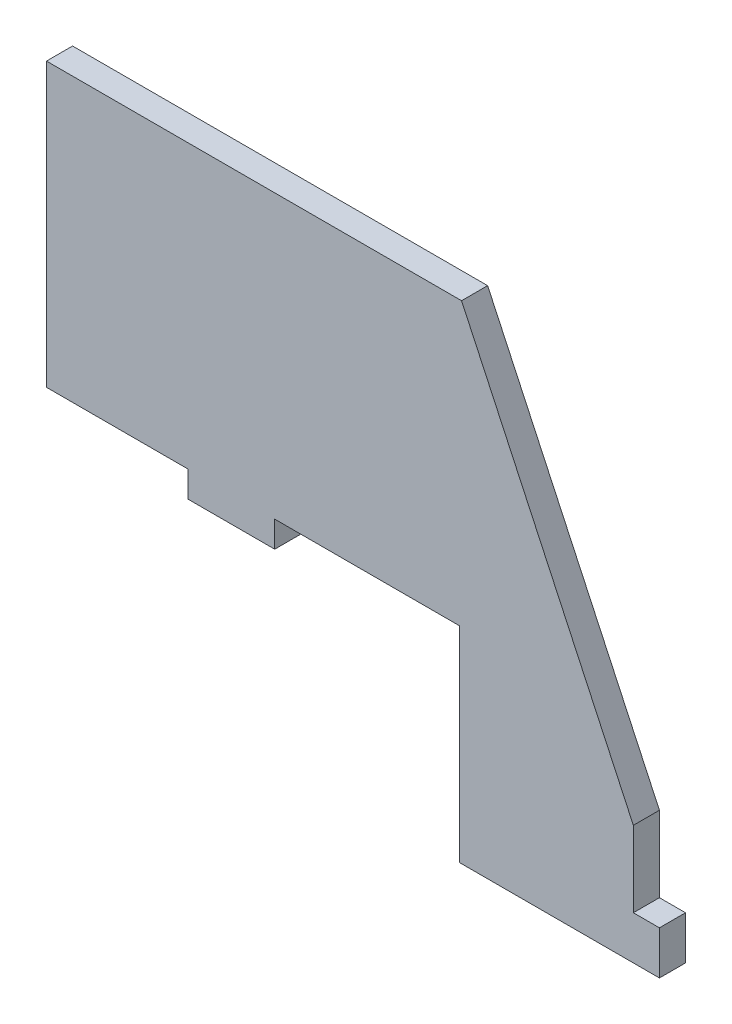
ISO-10303-21;
HEADER;
FILE_DESCRIPTION(('STEP AP214'),'2;1');
FILE_NAME('part.step','',(''),(''),'','','');
FILE_SCHEMA(('AUTOMOTIVE_DESIGN { 1 0 10303 214 1 1 1 1 }'));
ENDSEC;
DATA;
#1=APPLICATION_CONTEXT('core data for automotive mechanical design processes');
#2=APPLICATION_PROTOCOL_DEFINITION('international standard','automotive_design',2000,#1);
#3=PRODUCT_CONTEXT('',#1,'mechanical');
#4=PRODUCT('Part','Part','',(#3));
#5=PRODUCT_RELATED_PRODUCT_CATEGORY('part','',(#4));
#6=PRODUCT_DEFINITION_FORMATION('','',#4);
#7=PRODUCT_DEFINITION_CONTEXT('part definition',#1,'design');
#8=PRODUCT_DEFINITION('design','',#6,#7);
#9=PRODUCT_DEFINITION_SHAPE('','',#8);
#10=(LENGTH_UNIT() NAMED_UNIT(*) SI_UNIT(.MILLI.,.METRE.));
#11=(NAMED_UNIT(*) PLANE_ANGLE_UNIT() SI_UNIT($,.RADIAN.));
#12=(NAMED_UNIT(*) SI_UNIT($,.STERADIAN.) SOLID_ANGLE_UNIT());
#13=UNCERTAINTY_MEASURE_WITH_UNIT(LENGTH_MEASURE(1.E-05),#10,'distance_accuracy_value','');
#14=(GEOMETRIC_REPRESENTATION_CONTEXT(3) GLOBAL_UNCERTAINTY_ASSIGNED_CONTEXT((#13)) GLOBAL_UNIT_ASSIGNED_CONTEXT((#10,
#11,#12)) REPRESENTATION_CONTEXT('',''));
#15=CARTESIAN_POINT('',(0.,0.,0.));
#16=DIRECTION('',(0.,0.,1.));
#17=DIRECTION('',(1.,0.,0.));
#18=AXIS2_PLACEMENT_3D('',#15,#16,#17);
#19=CARTESIAN_POINT('',(-38.5,-8.91500000000001,0.));
#20=DIRECTION('',(0.,1.,0.));
#21=DIRECTION('',(0.,0.,1.));
#22=AXIS2_PLACEMENT_3D('',#19,#20,#21);
#23=PLANE('',#22);
#24=DIRECTION('',(-1.,0.,0.));
#25=VECTOR('',#24,1.);
#26=CARTESIAN_POINT('',(-38.5,-8.91500000000001,0.));
#27=LINE('',#26,#25);
#28=CARTESIAN_POINT('',(-35.,-8.91500000000001,0.));
#29=VERTEX_POINT('',#28);
#30=CARTESIAN_POINT('',(-67.5,-8.91500000000001,0.));
#31=VERTEX_POINT('',#30);
#32=EDGE_CURVE('E50',#29,#31,#27,.T.);
#33=ORIENTED_EDGE('',*,*,#32,.F.);
#34=DIRECTION('',(0.,0.,1.));
#35=VECTOR('',#34,1.);
#36=CARTESIAN_POINT('',(-35.,-8.915,0.));
#37=LINE('',#36,#35);
#38=CARTESIAN_POINT('',(-35.,-8.915,6.));
#39=VERTEX_POINT('',#38);
#40=EDGE_CURVE('E154',#29,#39,#37,.T.);
#41=ORIENTED_EDGE('',*,*,#40,.T.);
#42=DIRECTION('',(-1.,0.,0.));
#43=VECTOR('',#42,1.);
#44=CARTESIAN_POINT('',(-38.5,-8.91500000000001,6.));
#45=LINE('',#44,#43);
#46=CARTESIAN_POINT('',(-67.5,-8.91500000000001,6.));
#47=VERTEX_POINT('',#46);
#48=EDGE_CURVE('E221',#39,#47,#45,.T.);
#49=ORIENTED_EDGE('',*,*,#48,.T.);
#50=DIRECTION('',(0.,0.,1.));
#51=VECTOR('',#50,1.);
#52=CARTESIAN_POINT('',(-67.5,-8.91500000000001,0.));
#53=LINE('',#52,#51);
#54=EDGE_CURVE('E226',#31,#47,#53,.T.);
#55=ORIENTED_EDGE('',*,*,#54,.F.);
#56=EDGE_LOOP('',(#33,#41,#49,#55));
#57=FACE_BOUND('',#56,.T.);
#58=ADVANCED_FACE('F33',(#57),#23,.F.);
#59=CARTESIAN_POINT('',(67.5,56.085,6.));
#60=DIRECTION('',(-1.,0.,0.));
#61=DIRECTION('',(0.,0.,1.));
#62=AXIS2_PLACEMENT_3D('',#59,#60,#61);
#63=PLANE('',#62);
#64=DIRECTION('',(0.,0.,1.));
#65=VECTOR('',#64,1.);
#66=CARTESIAN_POINT('',(67.5,-46.085,0.));
#67=LINE('',#66,#65);
#68=CARTESIAN_POINT('',(67.5,-46.085,0.));
#69=VERTEX_POINT('',#68);
#70=CARTESIAN_POINT('',(67.5,-46.085,6.));
#71=VERTEX_POINT('',#70);
#72=EDGE_CURVE('E180',#69,#71,#67,.T.);
#73=ORIENTED_EDGE('',*,*,#72,.F.);
#74=DIRECTION('',(0.,1.,0.));
#75=VECTOR('',#74,1.);
#76=CARTESIAN_POINT('',(67.5,56.085,0.));
#77=LINE('',#76,#75);
#78=CARTESIAN_POINT('',(67.5,-28.6649999999999,0.));
#79=VERTEX_POINT('',#78);
#80=EDGE_CURVE('E242',#69,#79,#77,.T.);
#81=ORIENTED_EDGE('',*,*,#80,.T.);
#82=DIRECTION('',(0.,0.,1.));
#83=VECTOR('',#82,1.);
#84=CARTESIAN_POINT('',(67.5,-28.665,0.));
#85=LINE('',#84,#83);
#86=CARTESIAN_POINT('',(67.5,-28.665,6.));
#87=VERTEX_POINT('',#86);
#88=EDGE_CURVE('E207',#79,#87,#85,.T.);
#89=ORIENTED_EDGE('',*,*,#88,.T.);
#90=DIRECTION('',(0.,1.,0.));
#91=VECTOR('',#90,1.);
#92=CARTESIAN_POINT('',(67.5,56.085,6.));
#93=LINE('',#92,#91);
#94=EDGE_CURVE('E185',#71,#87,#93,.T.);
#95=ORIENTED_EDGE('',*,*,#94,.F.);
#96=EDGE_LOOP('',(#73,#81,#89,#95));
#97=FACE_BOUND('',#96,.T.);
#98=ADVANCED_FACE('F261',(#97),#63,.F.);
#99=CARTESIAN_POINT('',(-67.5,56.085,6.));
#100=DIRECTION('',(1.,0.,0.));
#101=DIRECTION('',(0.,0.,-1.));
#102=AXIS2_PLACEMENT_3D('',#99,#100,#101);
#103=PLANE('',#102);
#104=DIRECTION('',(0.,-1.,0.));
#105=VECTOR('',#104,1.);
#106=CARTESIAN_POINT('',(-67.5,56.085,0.));
#107=LINE('',#106,#105);
#108=CARTESIAN_POINT('',(-67.5,56.085,0.));
#109=VERTEX_POINT('',#108);
#110=EDGE_CURVE('E225',#109,#31,#107,.T.);
#111=ORIENTED_EDGE('',*,*,#110,.T.);
#112=ORIENTED_EDGE('',*,*,#54,.T.);
#113=DIRECTION('',(0.,-1.,0.));
#114=VECTOR('',#113,1.);
#115=CARTESIAN_POINT('',(-67.5,56.085,6.));
#116=LINE('',#115,#114);
#117=CARTESIAN_POINT('',(-67.5,56.085,6.));
#118=VERTEX_POINT('',#117);
#119=EDGE_CURVE('E230',#118,#47,#116,.T.);
#120=ORIENTED_EDGE('',*,*,#119,.F.);
#121=DIRECTION('',(0.,0.,-1.));
#122=VECTOR('',#121,1.);
#123=CARTESIAN_POINT('',(-67.5,56.085,6.));
#124=LINE('',#123,#122);
#125=EDGE_CURVE('E11',#118,#109,#124,.T.);
#126=ORIENTED_EDGE('',*,*,#125,.T.);
#127=EDGE_LOOP('',(#111,#112,#120,#126));
#128=FACE_BOUND('',#127,.T.);
#129=ADVANCED_FACE('F35',(#128),#103,.F.);
#130=CARTESIAN_POINT('',(-67.5,-56.085,6.));
#131=DIRECTION('',(0.,1.,0.));
#132=DIRECTION('',(0.,0.,1.));
#133=AXIS2_PLACEMENT_3D('',#130,#131,#132);
#134=PLANE('',#133);
#135=DIRECTION('',(1.,0.,0.));
#136=VECTOR('',#135,1.);
#137=CARTESIAN_POINT('',(-67.5,-56.085,6.));
#138=LINE('',#137,#136);
#139=CARTESIAN_POINT('',(27.5,-56.085,6.));
#140=VERTEX_POINT('',#139);
#141=CARTESIAN_POINT('',(73.5,-56.085,6.));
#142=VERTEX_POINT('',#141);
#143=EDGE_CURVE('E233',#140,#142,#138,.T.);
#144=ORIENTED_EDGE('',*,*,#143,.F.);
#145=DIRECTION('',(0.,0.,1.));
#146=VECTOR('',#145,1.);
#147=CARTESIAN_POINT('',(27.5,-56.085,0.));
#148=LINE('',#147,#146);
#149=CARTESIAN_POINT('',(27.5,-56.085,0.));
#150=VERTEX_POINT('',#149);
#151=EDGE_CURVE('E223',#150,#140,#148,.T.);
#152=ORIENTED_EDGE('',*,*,#151,.F.);
#153=DIRECTION('',(1.,0.,0.));
#154=VECTOR('',#153,1.);
#155=CARTESIAN_POINT('',(-67.5,-56.085,0.));
#156=LINE('',#155,#154);
#157=CARTESIAN_POINT('',(73.5,-56.085,0.));
#158=VERTEX_POINT('',#157);
#159=EDGE_CURVE('E240',#150,#158,#156,.T.);
#160=ORIENTED_EDGE('',*,*,#159,.T.);
#161=DIRECTION('',(0.,0.,1.));
#162=VECTOR('',#161,1.);
#163=CARTESIAN_POINT('',(73.5,-56.085,0.));
#164=LINE('',#163,#162);
#165=EDGE_CURVE('E192',#158,#142,#164,.T.);
#166=ORIENTED_EDGE('',*,*,#165,.T.);
#167=EDGE_LOOP('',(#144,#152,#160,#166));
#168=FACE_BOUND('',#167,.T.);
#169=ADVANCED_FACE('F270',(#168),#134,.F.);
#170=CARTESIAN_POINT('',(-67.5,56.085,6.));
#171=DIRECTION('',(0.,-1.,0.));
#172=DIRECTION('',(0.,0.,-1.));
#173=AXIS2_PLACEMENT_3D('',#170,#171,#172);
#174=PLANE('',#173);
#175=DIRECTION('',(-1.,0.,0.));
#176=VECTOR('',#175,1.);
#177=CARTESIAN_POINT('',(-67.5,56.085,6.));
#178=LINE('',#177,#176);
#179=CARTESIAN_POINT('',(27.9804259713637,56.085,6.));
#180=VERTEX_POINT('',#179);
#181=EDGE_CURVE('E42',#180,#118,#178,.T.);
#182=ORIENTED_EDGE('',*,*,#181,.F.);
#183=DIRECTION('',(0.,0.,1.));
#184=VECTOR('',#183,1.);
#185=CARTESIAN_POINT('',(27.9804259713637,56.085,0.));
#186=LINE('',#185,#184);
#187=CARTESIAN_POINT('',(27.9804259713637,56.085,0.));
#188=VERTEX_POINT('',#187);
#189=EDGE_CURVE('E204',#188,#180,#186,.T.);
#190=ORIENTED_EDGE('',*,*,#189,.F.);
#191=DIRECTION('',(-1.,0.,0.));
#192=VECTOR('',#191,1.);
#193=CARTESIAN_POINT('',(-67.5,56.085,0.));
#194=LINE('',#193,#192);
#195=EDGE_CURVE('E234',#188,#109,#194,.T.);
#196=ORIENTED_EDGE('',*,*,#195,.T.);
#197=ORIENTED_EDGE('',*,*,#125,.F.);
#198=EDGE_LOOP('',(#182,#190,#196,#197));
#199=FACE_BOUND('',#198,.T.);
#200=ADVANCED_FACE('F252',(#199),#174,.F.);
#201=CARTESIAN_POINT('',(0.,0.,6.));
#202=DIRECTION('',(0.,0.,1.));
#203=DIRECTION('',(1.,0.,0.));
#204=AXIS2_PLACEMENT_3D('',#201,#202,#203);
#205=PLANE('',#204);
#206=DIRECTION('',(0.422618261740701,-0.906307787036649,0.));
#207=VECTOR('',#206,1.);
#208=CARTESIAN_POINT('',(67.5,-28.665,6.));
#209=LINE('',#208,#207);
#210=EDGE_CURVE('E184',#180,#87,#209,.T.);
#211=ORIENTED_EDGE('',*,*,#210,.F.);
#212=ORIENTED_EDGE('',*,*,#181,.T.);
#213=ORIENTED_EDGE('',*,*,#119,.T.);
#214=ORIENTED_EDGE('',*,*,#48,.F.);
#215=DIRECTION('',(0.,-1.,0.));
#216=VECTOR('',#215,1.);
#217=CARTESIAN_POINT('',(-35.,-8.915,6.));
#218=LINE('',#217,#216);
#219=CARTESIAN_POINT('',(-35.,-14.915,6.));
#220=VERTEX_POINT('',#219);
#221=EDGE_CURVE('E161',#39,#220,#218,.T.);
#222=ORIENTED_EDGE('',*,*,#221,.T.);
#223=DIRECTION('',(1.,0.,0.));
#224=VECTOR('',#223,1.);
#225=CARTESIAN_POINT('',(-35.,-14.915,6.));
#226=LINE('',#225,#224);
#227=CARTESIAN_POINT('',(-15.,-14.915,6.));
#228=VERTEX_POINT('',#227);
#229=EDGE_CURVE('E137',#220,#228,#226,.T.);
#230=ORIENTED_EDGE('',*,*,#229,.T.);
#231=DIRECTION('',(0.,1.,0.));
#232=VECTOR('',#231,1.);
#233=CARTESIAN_POINT('',(-15.,-8.915,6.));
#234=LINE('',#233,#232);
#235=CARTESIAN_POINT('',(-15.,-8.91500000000001,6.));
#236=VERTEX_POINT('',#235);
#237=EDGE_CURVE('E155',#228,#236,#234,.T.);
#238=ORIENTED_EDGE('',*,*,#237,.T.);
#239=CARTESIAN_POINT('',(27.5,-8.915,6.));
#240=VERTEX_POINT('',#239);
#241=EDGE_CURVE('E215',#240,#236,#45,.T.);
#242=ORIENTED_EDGE('',*,*,#241,.F.);
#243=DIRECTION('',(0.,1.,0.));
#244=VECTOR('',#243,1.);
#245=CARTESIAN_POINT('',(27.5,-56.085,6.));
#246=LINE('',#245,#244);
#247=EDGE_CURVE('E210',#140,#240,#246,.T.);
#248=ORIENTED_EDGE('',*,*,#247,.F.);
#249=ORIENTED_EDGE('',*,*,#143,.T.);
#250=DIRECTION('',(0.,1.,0.));
#251=VECTOR('',#250,1.);
#252=CARTESIAN_POINT('',(73.5,-56.085,6.));
#253=LINE('',#252,#251);
#254=CARTESIAN_POINT('',(73.5,-46.085,6.));
#255=VERTEX_POINT('',#254);
#256=EDGE_CURVE('E165',#142,#255,#253,.T.);
#257=ORIENTED_EDGE('',*,*,#256,.T.);
#258=DIRECTION('',(-1.,0.,0.));
#259=VECTOR('',#258,1.);
#260=CARTESIAN_POINT('',(67.5,-46.085,6.));
#261=LINE('',#260,#259);
#262=EDGE_CURVE('E172',#255,#71,#261,.T.);
#263=ORIENTED_EDGE('',*,*,#262,.T.);
#264=ORIENTED_EDGE('',*,*,#94,.T.);
#265=EDGE_LOOP('',(#211,#212,#213,#214,#222,#230,#238,#242,#248,#249,#257,#263,#264));
#266=FACE_BOUND('',#265,.T.);
#267=ADVANCED_FACE('F258',(#266),#205,.T.);
#268=CARTESIAN_POINT('',(0.,0.,0.));
#269=DIRECTION('',(0.,0.,1.));
#270=DIRECTION('',(1.,0.,0.));
#271=AXIS2_PLACEMENT_3D('',#268,#269,#270);
#272=PLANE('',#271);
#273=ORIENTED_EDGE('',*,*,#195,.F.);
#274=DIRECTION('',(0.422618261740701,-0.906307787036649,0.));
#275=VECTOR('',#274,1.);
#276=CARTESIAN_POINT('',(67.5,-28.665,0.));
#277=LINE('',#276,#275);
#278=EDGE_CURVE('E201',#188,#79,#277,.T.);
#279=ORIENTED_EDGE('',*,*,#278,.T.);
#280=ORIENTED_EDGE('',*,*,#80,.F.);
#281=DIRECTION('',(-1.,0.,0.));
#282=VECTOR('',#281,1.);
#283=CARTESIAN_POINT('',(67.5,-46.085,0.));
#284=LINE('',#283,#282);
#285=CARTESIAN_POINT('',(73.5,-46.085,0.));
#286=VERTEX_POINT('',#285);
#287=EDGE_CURVE('E171',#286,#69,#284,.T.);
#288=ORIENTED_EDGE('',*,*,#287,.F.);
#289=DIRECTION('',(0.,1.,0.));
#290=VECTOR('',#289,1.);
#291=CARTESIAN_POINT('',(73.5,-56.085,0.));
#292=LINE('',#291,#290);
#293=EDGE_CURVE('E168',#158,#286,#292,.T.);
#294=ORIENTED_EDGE('',*,*,#293,.F.);
#295=ORIENTED_EDGE('',*,*,#159,.F.);
#296=DIRECTION('',(0.,1.,0.));
#297=VECTOR('',#296,1.);
#298=CARTESIAN_POINT('',(27.5,-56.085,0.));
#299=LINE('',#298,#297);
#300=CARTESIAN_POINT('',(27.5,-8.915,0.));
#301=VERTEX_POINT('',#300);
#302=EDGE_CURVE('E212',#150,#301,#299,.T.);
#303=ORIENTED_EDGE('',*,*,#302,.T.);
#304=CARTESIAN_POINT('',(-15.,-8.91500000000001,0.));
#305=VERTEX_POINT('',#304);
#306=EDGE_CURVE('E216',#301,#305,#27,.T.);
#307=ORIENTED_EDGE('',*,*,#306,.T.);
#308=DIRECTION('',(0.,1.,0.));
#309=VECTOR('',#308,1.);
#310=CARTESIAN_POINT('',(-15.,-8.915,0.));
#311=LINE('',#310,#309);
#312=CARTESIAN_POINT('',(-15.,-14.915,0.));
#313=VERTEX_POINT('',#312);
#314=EDGE_CURVE('E143',#313,#305,#311,.T.);
#315=ORIENTED_EDGE('',*,*,#314,.F.);
#316=DIRECTION('',(1.,0.,0.));
#317=VECTOR('',#316,1.);
#318=CARTESIAN_POINT('',(-35.,-14.915,0.));
#319=LINE('',#318,#317);
#320=CARTESIAN_POINT('',(-35.,-14.915,0.));
#321=VERTEX_POINT('',#320);
#322=EDGE_CURVE('E135',#321,#313,#319,.T.);
#323=ORIENTED_EDGE('',*,*,#322,.F.);
#324=DIRECTION('',(0.,-1.,0.));
#325=VECTOR('',#324,1.);
#326=CARTESIAN_POINT('',(-35.,-8.915,0.));
#327=LINE('',#326,#325);
#328=EDGE_CURVE('E150',#29,#321,#327,.T.);
#329=ORIENTED_EDGE('',*,*,#328,.F.);
#330=ORIENTED_EDGE('',*,*,#32,.T.);
#331=ORIENTED_EDGE('',*,*,#110,.F.);
#332=EDGE_LOOP('',(#273,#279,#280,#288,#294,#295,#303,#307,#315,#323,#329,#330,#331));
#333=FACE_BOUND('',#332,.T.);
#334=ADVANCED_FACE('F149',(#333),#272,.F.);
#335=CARTESIAN_POINT('',(27.5,-56.085,0.));
#336=DIRECTION('',(1.,0.,0.));
#337=DIRECTION('',(0.,0.,-1.));
#338=AXIS2_PLACEMENT_3D('',#335,#336,#337);
#339=PLANE('',#338);
#340=ORIENTED_EDGE('',*,*,#247,.T.);
#341=DIRECTION('',(0.,0.,1.));
#342=VECTOR('',#341,1.);
#343=CARTESIAN_POINT('',(27.5,-8.915,0.));
#344=LINE('',#343,#342);
#345=EDGE_CURVE('E218',#301,#240,#344,.T.);
#346=ORIENTED_EDGE('',*,*,#345,.F.);
#347=ORIENTED_EDGE('',*,*,#302,.F.);
#348=ORIENTED_EDGE('',*,*,#151,.T.);
#349=EDGE_LOOP('',(#340,#346,#347,#348));
#350=FACE_BOUND('',#349,.T.);
#351=ADVANCED_FACE('F272',(#350),#339,.F.);
#352=ORIENTED_EDGE('',*,*,#241,.T.);
#353=DIRECTION('',(0.,0.,1.));
#354=VECTOR('',#353,1.);
#355=CARTESIAN_POINT('',(-15.,-8.915,0.));
#356=LINE('',#355,#354);
#357=EDGE_CURVE('E58',#305,#236,#356,.T.);
#358=ORIENTED_EDGE('',*,*,#357,.F.);
#359=ORIENTED_EDGE('',*,*,#306,.F.);
#360=ORIENTED_EDGE('',*,*,#345,.T.);
#361=EDGE_LOOP('',(#352,#358,#359,#360));
#362=FACE_BOUND('',#361,.T.);
#363=ADVANCED_FACE('F275',(#362),#23,.F.);
#364=CARTESIAN_POINT('',(67.5,-28.665,0.));
#365=DIRECTION('',(-0.906307787036649,-0.422618261740701,0.));
#366=DIRECTION('',(0.422618261740701,-0.906307787036649,0.));
#367=AXIS2_PLACEMENT_3D('',#364,#365,#366);
#368=PLANE('',#367);
#369=ORIENTED_EDGE('',*,*,#210,.T.);
#370=ORIENTED_EDGE('',*,*,#88,.F.);
#371=ORIENTED_EDGE('',*,*,#278,.F.);
#372=ORIENTED_EDGE('',*,*,#189,.T.);
#373=EDGE_LOOP('',(#369,#370,#371,#372));
#374=FACE_BOUND('',#373,.T.);
#375=ADVANCED_FACE('F260',(#374),#368,.F.);
#376=CARTESIAN_POINT('',(67.5,-46.085,0.));
#377=DIRECTION('',(0.,1.,0.));
#378=DIRECTION('',(0.,0.,1.));
#379=AXIS2_PLACEMENT_3D('',#376,#377,#378);
#380=PLANE('',#379);
#381=ORIENTED_EDGE('',*,*,#262,.F.);
#382=DIRECTION('',(0.,0.,1.));
#383=VECTOR('',#382,1.);
#384=CARTESIAN_POINT('',(73.5,-46.085,0.));
#385=LINE('',#384,#383);
#386=EDGE_CURVE('E177',#286,#255,#385,.T.);
#387=ORIENTED_EDGE('',*,*,#386,.F.);
#388=ORIENTED_EDGE('',*,*,#287,.T.);
#389=ORIENTED_EDGE('',*,*,#72,.T.);
#390=EDGE_LOOP('',(#381,#387,#388,#389));
#391=FACE_BOUND('',#390,.T.);
#392=ADVANCED_FACE('F263',(#391),#380,.T.);
#393=CARTESIAN_POINT('',(73.5,-56.085,0.));
#394=DIRECTION('',(1.,0.,0.));
#395=DIRECTION('',(0.,0.,-1.));
#396=AXIS2_PLACEMENT_3D('',#393,#394,#395);
#397=PLANE('',#396);
#398=ORIENTED_EDGE('',*,*,#256,.F.);
#399=ORIENTED_EDGE('',*,*,#165,.F.);
#400=ORIENTED_EDGE('',*,*,#293,.T.);
#401=ORIENTED_EDGE('',*,*,#386,.T.);
#402=EDGE_LOOP('',(#398,#399,#400,#401));
#403=FACE_BOUND('',#402,.T.);
#404=ADVANCED_FACE('F266',(#403),#397,.T.);
#405=CARTESIAN_POINT('',(-35.,-8.915,0.));
#406=DIRECTION('',(-1.,0.,0.));
#407=DIRECTION('',(0.,0.,1.));
#408=AXIS2_PLACEMENT_3D('',#405,#406,#407);
#409=PLANE('',#408);
#410=ORIENTED_EDGE('',*,*,#221,.F.);
#411=ORIENTED_EDGE('',*,*,#40,.F.);
#412=ORIENTED_EDGE('',*,*,#328,.T.);
#413=DIRECTION('',(0.,0.,1.));
#414=VECTOR('',#413,1.);
#415=CARTESIAN_POINT('',(-35.,-14.915,0.));
#416=LINE('',#415,#414);
#417=EDGE_CURVE('E132',#321,#220,#416,.T.);
#418=ORIENTED_EDGE('',*,*,#417,.T.);
#419=EDGE_LOOP('',(#410,#411,#412,#418));
#420=FACE_BOUND('',#419,.T.);
#421=ADVANCED_FACE('F153',(#420),#409,.T.);
#422=CARTESIAN_POINT('',(-15.,-8.915,0.));
#423=DIRECTION('',(1.,0.,0.));
#424=DIRECTION('',(0.,1.,0.));
#425=AXIS2_PLACEMENT_3D('',#422,#423,#424);
#426=PLANE('',#425);
#427=ORIENTED_EDGE('',*,*,#237,.F.);
#428=DIRECTION('',(0.,0.,1.));
#429=VECTOR('',#428,1.);
#430=CARTESIAN_POINT('',(-15.,-14.915,0.));
#431=LINE('',#430,#429);
#432=EDGE_CURVE('E142',#313,#228,#431,.T.);
#433=ORIENTED_EDGE('',*,*,#432,.F.);
#434=ORIENTED_EDGE('',*,*,#314,.T.);
#435=ORIENTED_EDGE('',*,*,#357,.T.);
#436=EDGE_LOOP('',(#427,#433,#434,#435));
#437=FACE_BOUND('',#436,.T.);
#438=ADVANCED_FACE('F277',(#437),#426,.T.);
#439=CARTESIAN_POINT('',(-35.,-14.915,0.));
#440=DIRECTION('',(0.,-1.,0.));
#441=DIRECTION('',(0.,0.,-1.));
#442=AXIS2_PLACEMENT_3D('',#439,#440,#441);
#443=PLANE('',#442);
#444=ORIENTED_EDGE('',*,*,#229,.F.);
#445=ORIENTED_EDGE('',*,*,#417,.F.);
#446=ORIENTED_EDGE('',*,*,#322,.T.);
#447=ORIENTED_EDGE('',*,*,#432,.T.);
#448=EDGE_LOOP('',(#444,#445,#446,#447));
#449=FACE_BOUND('',#448,.T.);
#450=ADVANCED_FACE('F134',(#449),#443,.T.);
#451=CLOSED_SHELL('',(#58,#98,#129,#169,#200,#267,#334,#351,#363,#375,#392,#404,#421,#438,#450));
#452=MANIFOLD_SOLID_BREP('B2',#451);
#453=ADVANCED_BREP_SHAPE_REPRESENTATION('',(#18,#452),#14);
#454=SHAPE_DEFINITION_REPRESENTATION(#9,#453);
ENDSEC;
END-ISO-10303-21;
